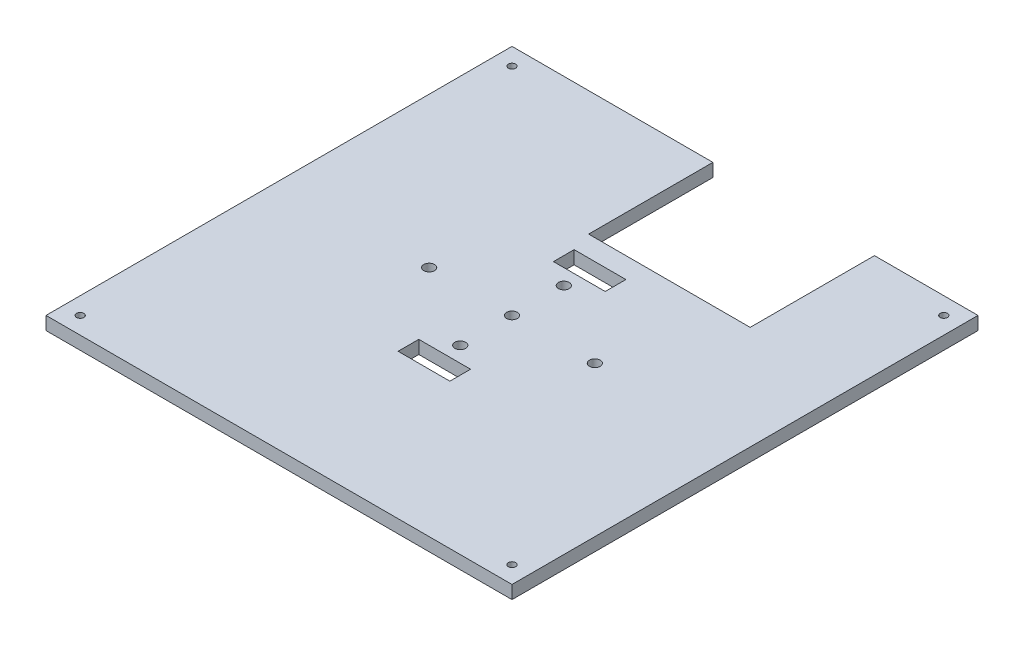
ISO-10303-21;
HEADER;
FILE_DESCRIPTION(('STEP AP214'),'2;1');
FILE_NAME('part.step','',(''),(''),'','','');
FILE_SCHEMA(('AUTOMOTIVE_DESIGN { 1 0 10303 214 1 1 1 1 }'));
ENDSEC;
DATA;
#1=APPLICATION_CONTEXT('core data for automotive mechanical design processes');
#2=APPLICATION_PROTOCOL_DEFINITION('international standard','automotive_design',2000,#1);
#3=PRODUCT_CONTEXT('',#1,'mechanical');
#4=PRODUCT('Part','Part','',(#3));
#5=PRODUCT_RELATED_PRODUCT_CATEGORY('part','',(#4));
#6=PRODUCT_DEFINITION_FORMATION('','',#4);
#7=PRODUCT_DEFINITION_CONTEXT('part definition',#1,'design');
#8=PRODUCT_DEFINITION('design','',#6,#7);
#9=PRODUCT_DEFINITION_SHAPE('','',#8);
#10=(LENGTH_UNIT() NAMED_UNIT(*) SI_UNIT(.MILLI.,.METRE.));
#11=(NAMED_UNIT(*) PLANE_ANGLE_UNIT() SI_UNIT($,.RADIAN.));
#12=(NAMED_UNIT(*) SI_UNIT($,.STERADIAN.) SOLID_ANGLE_UNIT());
#13=UNCERTAINTY_MEASURE_WITH_UNIT(LENGTH_MEASURE(1.E-05),#10,'distance_accuracy_value','');
#14=(GEOMETRIC_REPRESENTATION_CONTEXT(3) GLOBAL_UNCERTAINTY_ASSIGNED_CONTEXT((#13)) GLOBAL_UNIT_ASSIGNED_CONTEXT((#10,
#11,#12)) REPRESENTATION_CONTEXT('',''));
#15=CARTESIAN_POINT('',(0.,0.,0.));
#16=DIRECTION('',(0.,0.,1.));
#17=DIRECTION('',(1.,0.,0.));
#18=AXIS2_PLACEMENT_3D('',#15,#16,#17);
#19=CARTESIAN_POINT('',(0.,6.35,-225.));
#20=DIRECTION('',(0.,0.,1.));
#21=DIRECTION('',(1.,0.,0.));
#22=AXIS2_PLACEMENT_3D('',#19,#20,#21);
#23=PLANE('',#22);
#24=DIRECTION('',(-1.,0.,0.));
#25=VECTOR('',#24,1.);
#26=CARTESIAN_POINT('',(0.,6.35,-225.));
#27=LINE('',#26,#25);
#28=CARTESIAN_POINT('',(97.,6.35,-225.));
#29=VERTEX_POINT('',#28);
#30=CARTESIAN_POINT('',(0.,6.35,-225.));
#31=VERTEX_POINT('',#30);
#32=EDGE_CURVE('E167',#29,#31,#27,.T.);
#33=ORIENTED_EDGE('',*,*,#32,.F.);
#34=DIRECTION('',(0.,1.,0.));
#35=VECTOR('',#34,1.);
#36=CARTESIAN_POINT('',(97.,-98.4073168011403,-225.));
#37=LINE('',#36,#35);
#38=CARTESIAN_POINT('',(97.,0.,-225.));
#39=VERTEX_POINT('',#38);
#40=EDGE_CURVE('E155',#39,#29,#37,.T.);
#41=ORIENTED_EDGE('',*,*,#40,.F.);
#42=DIRECTION('',(-1.,0.,0.));
#43=VECTOR('',#42,1.);
#44=CARTESIAN_POINT('',(0.,0.,-225.));
#45=LINE('',#44,#43);
#46=CARTESIAN_POINT('',(0.,0.,-225.));
#47=VERTEX_POINT('',#46);
#48=EDGE_CURVE('E165',#39,#47,#45,.T.);
#49=ORIENTED_EDGE('',*,*,#48,.T.);
#50=DIRECTION('',(0.,-1.,0.));
#51=VECTOR('',#50,1.);
#52=CARTESIAN_POINT('',(0.,6.35,-225.));
#53=LINE('',#52,#51);
#54=EDGE_CURVE('E184',#31,#47,#53,.T.);
#55=ORIENTED_EDGE('',*,*,#54,.F.);
#56=EDGE_LOOP('',(#33,#41,#49,#55));
#57=FACE_BOUND('',#56,.T.);
#58=ADVANCED_FACE('F36',(#57),#23,.F.);
#59=CARTESIAN_POINT('',(0.,6.35,0.));
#60=DIRECTION('',(1.,0.,0.));
#61=DIRECTION('',(0.,0.,-1.));
#62=AXIS2_PLACEMENT_3D('',#59,#60,#61);
#63=PLANE('',#62);
#64=DIRECTION('',(0.,0.,1.));
#65=VECTOR('',#64,1.);
#66=CARTESIAN_POINT('',(0.,0.,0.));
#67=LINE('',#66,#65);
#68=CARTESIAN_POINT('',(0.,0.,0.));
#69=VERTEX_POINT('',#68);
#70=EDGE_CURVE('E174',#47,#69,#67,.T.);
#71=ORIENTED_EDGE('',*,*,#70,.T.);
#72=DIRECTION('',(0.,-1.,0.));
#73=VECTOR('',#72,1.);
#74=CARTESIAN_POINT('',(0.,6.35,0.));
#75=LINE('',#74,#73);
#76=CARTESIAN_POINT('',(0.,6.35,0.));
#77=VERTEX_POINT('',#76);
#78=EDGE_CURVE('E11',#77,#69,#75,.T.);
#79=ORIENTED_EDGE('',*,*,#78,.F.);
#80=DIRECTION('',(0.,0.,1.));
#81=VECTOR('',#80,1.);
#82=CARTESIAN_POINT('',(0.,6.35,0.));
#83=LINE('',#82,#81);
#84=EDGE_CURVE('E179',#31,#77,#83,.T.);
#85=ORIENTED_EDGE('',*,*,#84,.F.);
#86=ORIENTED_EDGE('',*,*,#54,.T.);
#87=EDGE_LOOP('',(#71,#79,#85,#86));
#88=FACE_BOUND('',#87,.T.);
#89=ADVANCED_FACE('F38',(#88),#63,.F.);
#90=CARTESIAN_POINT('',(0.,6.35,0.));
#91=DIRECTION('',(0.,0.,-1.));
#92=DIRECTION('',(-1.,0.,0.));
#93=AXIS2_PLACEMENT_3D('',#90,#91,#92);
#94=PLANE('',#93);
#95=DIRECTION('',(1.,0.,0.));
#96=VECTOR('',#95,1.);
#97=CARTESIAN_POINT('',(0.,0.,0.));
#98=LINE('',#97,#96);
#99=CARTESIAN_POINT('',(225.,0.,0.));
#100=VERTEX_POINT('',#99);
#101=EDGE_CURVE('E180',#69,#100,#98,.T.);
#102=ORIENTED_EDGE('',*,*,#101,.T.);
#103=DIRECTION('',(0.,-1.,0.));
#104=VECTOR('',#103,1.);
#105=CARTESIAN_POINT('',(225.,6.35,0.));
#106=LINE('',#105,#104);
#107=CARTESIAN_POINT('',(225.,6.35,0.));
#108=VERTEX_POINT('',#107);
#109=EDGE_CURVE('E44',#108,#100,#106,.T.);
#110=ORIENTED_EDGE('',*,*,#109,.F.);
#111=DIRECTION('',(1.,0.,0.));
#112=VECTOR('',#111,1.);
#113=CARTESIAN_POINT('',(0.,6.35,0.));
#114=LINE('',#113,#112);
#115=EDGE_CURVE('E216',#77,#108,#114,.T.);
#116=ORIENTED_EDGE('',*,*,#115,.F.);
#117=ORIENTED_EDGE('',*,*,#78,.T.);
#118=EDGE_LOOP('',(#102,#110,#116,#117));
#119=FACE_BOUND('',#118,.T.);
#120=ADVANCED_FACE('F214',(#119),#94,.F.);
#121=CARTESIAN_POINT('',(225.,6.35,0.));
#122=DIRECTION('',(-1.,0.,0.));
#123=DIRECTION('',(0.,0.,1.));
#124=AXIS2_PLACEMENT_3D('',#121,#122,#123);
#125=PLANE('',#124);
#126=DIRECTION('',(0.,0.,-1.));
#127=VECTOR('',#126,1.);
#128=CARTESIAN_POINT('',(225.,0.,0.));
#129=LINE('',#128,#127);
#130=CARTESIAN_POINT('',(225.,0.,-225.));
#131=VERTEX_POINT('',#130);
#132=EDGE_CURVE('E176',#100,#131,#129,.T.);
#133=ORIENTED_EDGE('',*,*,#132,.T.);
#134=DIRECTION('',(0.,-1.,0.));
#135=VECTOR('',#134,1.);
#136=CARTESIAN_POINT('',(225.,6.35,-225.));
#137=LINE('',#136,#135);
#138=CARTESIAN_POINT('',(225.,6.35,-225.));
#139=VERTEX_POINT('',#138);
#140=EDGE_CURVE('E186',#139,#131,#137,.T.);
#141=ORIENTED_EDGE('',*,*,#140,.F.);
#142=DIRECTION('',(0.,0.,-1.));
#143=VECTOR('',#142,1.);
#144=CARTESIAN_POINT('',(225.,6.35,0.));
#145=LINE('',#144,#143);
#146=EDGE_CURVE('E196',#108,#139,#145,.T.);
#147=ORIENTED_EDGE('',*,*,#146,.F.);
#148=ORIENTED_EDGE('',*,*,#109,.T.);
#149=EDGE_LOOP('',(#133,#141,#147,#148));
#150=FACE_BOUND('',#149,.T.);
#151=ADVANCED_FACE('F194',(#150),#125,.F.);
#152=CARTESIAN_POINT('',(175.,0.,-225.));
#153=VERTEX_POINT('',#152);
#154=EDGE_CURVE('E175',#131,#153,#45,.T.);
#155=ORIENTED_EDGE('',*,*,#154,.T.);
#156=DIRECTION('',(0.,1.,0.));
#157=VECTOR('',#156,1.);
#158=CARTESIAN_POINT('',(175.,-98.4073168011403,-225.));
#159=LINE('',#158,#157);
#160=CARTESIAN_POINT('',(175.,6.35,-225.));
#161=VERTEX_POINT('',#160);
#162=EDGE_CURVE('E205',#153,#161,#159,.T.);
#163=ORIENTED_EDGE('',*,*,#162,.T.);
#164=EDGE_CURVE('E187',#139,#161,#27,.T.);
#165=ORIENTED_EDGE('',*,*,#164,.F.);
#166=ORIENTED_EDGE('',*,*,#140,.T.);
#167=EDGE_LOOP('',(#155,#163,#165,#166));
#168=FACE_BOUND('',#167,.T.);
#169=ADVANCED_FACE('F203',(#168),#23,.F.);
#170=CARTESIAN_POINT('',(0.,6.35,0.));
#171=DIRECTION('',(0.,-1.,0.));
#172=DIRECTION('',(0.,0.,-1.));
#173=AXIS2_PLACEMENT_3D('',#170,#171,#172);
#174=PLANE('',#173);
#175=CARTESIAN_POINT('',(112.5,6.35,-137.5));
#176=DIRECTION('',(0.,1.,0.));
#177=DIRECTION('',(0.,0.,1.));
#178=AXIS2_PLACEMENT_3D('',#175,#176,#177);
#179=CIRCLE('',#178,2.6);
#180=CARTESIAN_POINT('',(112.5,6.35,-134.9));
#181=VERTEX_POINT('',#180);
#182=EDGE_CURVE('E268',#181,#181,#179,.T.);
#183=ORIENTED_EDGE('',*,*,#182,.F.);
#184=EDGE_LOOP('',(#183));
#185=FACE_BOUND('',#184,.T.);
#186=CARTESIAN_POINT('',(112.5,6.35,-87.5));
#187=DIRECTION('',(0.,1.,0.));
#188=DIRECTION('',(0.,0.,1.));
#189=AXIS2_PLACEMENT_3D('',#186,#187,#188);
#190=CIRCLE('',#189,2.6);
#191=CARTESIAN_POINT('',(112.5,6.35,-84.9));
#192=VERTEX_POINT('',#191);
#193=EDGE_CURVE('E267',#192,#192,#190,.T.);
#194=ORIENTED_EDGE('',*,*,#193,.F.);
#195=EDGE_LOOP('',(#194));
#196=FACE_BOUND('',#195,.T.);
#197=CARTESIAN_POINT('',(72.5,6.35,-112.5));
#198=DIRECTION('',(0.,1.,0.));
#199=DIRECTION('',(0.,0.,1.));
#200=AXIS2_PLACEMENT_3D('',#197,#198,#199);
#201=CIRCLE('',#200,2.6);
#202=CARTESIAN_POINT('',(72.5,6.35,-109.9));
#203=VERTEX_POINT('',#202);
#204=EDGE_CURVE('E256',#203,#203,#201,.T.);
#205=ORIENTED_EDGE('',*,*,#204,.F.);
#206=EDGE_LOOP('',(#205));
#207=FACE_BOUND('',#206,.T.);
#208=CARTESIAN_POINT('',(112.5,6.35,-112.5));
#209=DIRECTION('',(0.,1.,0.));
#210=DIRECTION('',(0.,0.,1.));
#211=AXIS2_PLACEMENT_3D('',#208,#209,#210);
#212=CIRCLE('',#211,2.6);
#213=CARTESIAN_POINT('',(112.5,6.35,-109.9));
#214=VERTEX_POINT('',#213);
#215=EDGE_CURVE('E255',#214,#214,#212,.T.);
#216=ORIENTED_EDGE('',*,*,#215,.F.);
#217=EDGE_LOOP('',(#216));
#218=FACE_BOUND('',#217,.T.);
#219=DIRECTION('',(0.,0.,1.));
#220=VECTOR('',#219,1.);
#221=CARTESIAN_POINT('',(100.,6.35,-145.));
#222=LINE('',#221,#220);
#223=CARTESIAN_POINT('',(100.,6.35,-155.));
#224=VERTEX_POINT('',#223);
#225=CARTESIAN_POINT('',(100.,6.35,-145.));
#226=VERTEX_POINT('',#225);
#227=EDGE_CURVE('E332',#224,#226,#222,.T.);
#228=ORIENTED_EDGE('',*,*,#227,.F.);
#229=DIRECTION('',(-1.,0.,0.));
#230=VECTOR('',#229,1.);
#231=CARTESIAN_POINT('',(125.,6.35,-155.));
#232=LINE('',#231,#230);
#233=CARTESIAN_POINT('',(125.,6.35,-155.));
#234=VERTEX_POINT('',#233);
#235=EDGE_CURVE('E329',#234,#224,#232,.T.);
#236=ORIENTED_EDGE('',*,*,#235,.F.);
#237=DIRECTION('',(0.,0.,-1.));
#238=VECTOR('',#237,1.);
#239=CARTESIAN_POINT('',(125.,6.35,-145.));
#240=LINE('',#239,#238);
#241=CARTESIAN_POINT('',(125.,6.35,-145.));
#242=VERTEX_POINT('',#241);
#243=EDGE_CURVE('E277',#242,#234,#240,.T.);
#244=ORIENTED_EDGE('',*,*,#243,.F.);
#245=DIRECTION('',(1.,0.,0.));
#246=VECTOR('',#245,1.);
#247=CARTESIAN_POINT('',(125.,6.35,-145.));
#248=LINE('',#247,#246);
#249=EDGE_CURVE('E51',#226,#242,#248,.T.);
#250=ORIENTED_EDGE('',*,*,#249,.F.);
#251=EDGE_LOOP('',(#228,#236,#244,#250));
#252=FACE_BOUND('',#251,.T.);
#253=DIRECTION('',(0.,0.,1.));
#254=VECTOR('',#253,1.);
#255=CARTESIAN_POINT('',(100.,6.35,-80.));
#256=LINE('',#255,#254);
#257=CARTESIAN_POINT('',(100.,6.35,-80.));
#258=VERTEX_POINT('',#257);
#259=CARTESIAN_POINT('',(100.,6.35,-70.));
#260=VERTEX_POINT('',#259);
#261=EDGE_CURVE('E302',#258,#260,#256,.T.);
#262=ORIENTED_EDGE('',*,*,#261,.F.);
#263=DIRECTION('',(-1.,0.,0.));
#264=VECTOR('',#263,1.);
#265=CARTESIAN_POINT('',(125.,6.35,-80.));
#266=LINE('',#265,#264);
#267=CARTESIAN_POINT('',(125.,6.35,-80.));
#268=VERTEX_POINT('',#267);
#269=EDGE_CURVE('E299',#268,#258,#266,.T.);
#270=ORIENTED_EDGE('',*,*,#269,.F.);
#271=DIRECTION('',(0.,0.,-1.));
#272=VECTOR('',#271,1.);
#273=CARTESIAN_POINT('',(125.,6.35,-80.));
#274=LINE('',#273,#272);
#275=CARTESIAN_POINT('',(125.,6.35,-70.));
#276=VERTEX_POINT('',#275);
#277=EDGE_CURVE('E296',#276,#268,#274,.T.);
#278=ORIENTED_EDGE('',*,*,#277,.F.);
#279=DIRECTION('',(1.,0.,0.));
#280=VECTOR('',#279,1.);
#281=CARTESIAN_POINT('',(125.,6.35,-70.));
#282=LINE('',#281,#280);
#283=EDGE_CURVE('E59',#260,#276,#282,.T.);
#284=ORIENTED_EDGE('',*,*,#283,.F.);
#285=EDGE_LOOP('',(#262,#270,#278,#284));
#286=FACE_BOUND('',#285,.T.);
#287=CARTESIAN_POINT('',(152.5,6.35,-112.5));
#288=DIRECTION('',(0.,1.,0.));
#289=DIRECTION('',(0.,0.,1.));
#290=AXIS2_PLACEMENT_3D('',#287,#288,#289);
#291=CIRCLE('',#290,2.59999999999999);
#292=CARTESIAN_POINT('',(152.5,6.35,-109.9));
#293=VERTEX_POINT('',#292);
#294=EDGE_CURVE('E248',#293,#293,#291,.T.);
#295=ORIENTED_EDGE('',*,*,#294,.F.);
#296=EDGE_LOOP('',(#295));
#297=FACE_BOUND('',#296,.T.);
#298=CARTESIAN_POINT('',(8.25999999999999,6.35,-216.74));
#299=DIRECTION('',(0.,1.,0.));
#300=DIRECTION('',(0.,0.,-1.));
#301=AXIS2_PLACEMENT_3D('',#298,#299,#300);
#302=CIRCLE('',#301,1.75000000000001);
#303=CARTESIAN_POINT('',(8.25999999999999,6.35,-218.49));
#304=VERTEX_POINT('',#303);
#305=EDGE_CURVE('E235',#304,#304,#302,.T.);
#306=ORIENTED_EDGE('',*,*,#305,.F.);
#307=EDGE_LOOP('',(#306));
#308=FACE_BOUND('',#307,.T.);
#309=CARTESIAN_POINT('',(216.74,6.35,-8.26000000000002));
#310=DIRECTION('',(0.,1.,0.));
#311=DIRECTION('',(0.,0.,-1.));
#312=AXIS2_PLACEMENT_3D('',#309,#310,#311);
#313=CIRCLE('',#312,1.75000000000001);
#314=CARTESIAN_POINT('',(216.74,6.35,-10.01));
#315=VERTEX_POINT('',#314);
#316=EDGE_CURVE('E228',#315,#315,#313,.T.);
#317=ORIENTED_EDGE('',*,*,#316,.F.);
#318=EDGE_LOOP('',(#317));
#319=FACE_BOUND('',#318,.T.);
#320=CARTESIAN_POINT('',(8.26000000000002,6.35,-8.25999999999996));
#321=DIRECTION('',(0.,1.,0.));
#322=DIRECTION('',(0.,0.,1.));
#323=AXIS2_PLACEMENT_3D('',#320,#321,#322);
#324=CIRCLE('',#323,1.75000000000001);
#325=CARTESIAN_POINT('',(8.26000000000002,6.35,-6.50999999999995));
#326=VERTEX_POINT('',#325);
#327=EDGE_CURVE('E240',#326,#326,#324,.T.);
#328=ORIENTED_EDGE('',*,*,#327,.F.);
#329=EDGE_LOOP('',(#328));
#330=FACE_BOUND('',#329,.T.);
#331=CARTESIAN_POINT('',(216.74,6.35,-216.74));
#332=DIRECTION('',(0.,1.,0.));
#333=DIRECTION('',(0.,0.,1.));
#334=AXIS2_PLACEMENT_3D('',#331,#332,#333);
#335=CIRCLE('',#334,1.75000000000001);
#336=CARTESIAN_POINT('',(216.74,6.35,-214.99));
#337=VERTEX_POINT('',#336);
#338=EDGE_CURVE('E222',#337,#337,#335,.T.);
#339=ORIENTED_EDGE('',*,*,#338,.F.);
#340=EDGE_LOOP('',(#339));
#341=FACE_BOUND('',#340,.T.);
#342=DIRECTION('',(1.,0.,0.));
#343=VECTOR('',#342,1.);
#344=CARTESIAN_POINT('',(175.,6.35,-165.));
#345=LINE('',#344,#343);
#346=CARTESIAN_POINT('',(97.,6.35,-165.));
#347=VERTEX_POINT('',#346);
#348=CARTESIAN_POINT('',(175.,6.35,-165.));
#349=VERTEX_POINT('',#348);
#350=EDGE_CURVE('E168',#347,#349,#345,.T.);
#351=ORIENTED_EDGE('',*,*,#350,.F.);
#352=DIRECTION('',(0.,0.,1.));
#353=VECTOR('',#352,1.);
#354=CARTESIAN_POINT('',(97.,6.35,-225.));
#355=LINE('',#354,#353);
#356=EDGE_CURVE('E344',#29,#347,#355,.T.);
#357=ORIENTED_EDGE('',*,*,#356,.F.);
#358=ORIENTED_EDGE('',*,*,#32,.T.);
#359=ORIENTED_EDGE('',*,*,#84,.T.);
#360=ORIENTED_EDGE('',*,*,#115,.T.);
#361=ORIENTED_EDGE('',*,*,#146,.T.);
#362=ORIENTED_EDGE('',*,*,#164,.T.);
#363=DIRECTION('',(0.,0.,-1.));
#364=VECTOR('',#363,1.);
#365=CARTESIAN_POINT('',(175.,6.35,-225.));
#366=LINE('',#365,#364);
#367=EDGE_CURVE('E308',#349,#161,#366,.T.);
#368=ORIENTED_EDGE('',*,*,#367,.F.);
#369=EDGE_LOOP('',(#351,#357,#358,#359,#360,#361,#362,#368));
#370=FACE_BOUND('',#369,.T.);
#371=ADVANCED_FACE('F351',(#185,#196,#207,#218,#252,#286,#297,#308,#319,#330,#341,#370),#174,.F.);
#372=CARTESIAN_POINT('',(0.,0.,0.));
#373=DIRECTION('',(0.,-1.,0.));
#374=DIRECTION('',(0.,0.,-1.));
#375=AXIS2_PLACEMENT_3D('',#372,#373,#374);
#376=PLANE('',#375);
#377=CARTESIAN_POINT('',(112.5,0.,-137.5));
#378=DIRECTION('',(0.,-1.,0.));
#379=DIRECTION('',(0.,0.,-1.));
#380=AXIS2_PLACEMENT_3D('',#377,#378,#379);
#381=CIRCLE('',#380,2.6);
#382=CARTESIAN_POINT('',(112.5,0.,-140.1));
#383=VERTEX_POINT('',#382);
#384=EDGE_CURVE('E264',#383,#383,#381,.F.);
#385=ORIENTED_EDGE('',*,*,#384,.T.);
#386=EDGE_LOOP('',(#385));
#387=FACE_BOUND('',#386,.T.);
#388=CARTESIAN_POINT('',(112.5,0.,-87.5));
#389=DIRECTION('',(0.,-1.,0.));
#390=DIRECTION('',(0.,0.,-1.));
#391=AXIS2_PLACEMENT_3D('',#388,#389,#390);
#392=CIRCLE('',#391,2.6);
#393=CARTESIAN_POINT('',(112.5,0.,-90.1));
#394=VERTEX_POINT('',#393);
#395=EDGE_CURVE('E259',#394,#394,#392,.F.);
#396=ORIENTED_EDGE('',*,*,#395,.T.);
#397=EDGE_LOOP('',(#396));
#398=FACE_BOUND('',#397,.T.);
#399=CARTESIAN_POINT('',(72.5,0.,-112.5));
#400=DIRECTION('',(0.,-1.,0.));
#401=DIRECTION('',(0.,0.,-1.));
#402=AXIS2_PLACEMENT_3D('',#399,#400,#401);
#403=CIRCLE('',#402,2.6);
#404=CARTESIAN_POINT('',(72.5,0.,-115.1));
#405=VERTEX_POINT('',#404);
#406=EDGE_CURVE('E252',#405,#405,#403,.F.);
#407=ORIENTED_EDGE('',*,*,#406,.T.);
#408=EDGE_LOOP('',(#407));
#409=FACE_BOUND('',#408,.T.);
#410=CARTESIAN_POINT('',(112.5,0.,-112.5));
#411=DIRECTION('',(0.,-1.,0.));
#412=DIRECTION('',(0.,0.,-1.));
#413=AXIS2_PLACEMENT_3D('',#410,#411,#412);
#414=CIRCLE('',#413,2.6);
#415=CARTESIAN_POINT('',(112.5,0.,-115.1));
#416=VERTEX_POINT('',#415);
#417=EDGE_CURVE('E251',#416,#416,#414,.F.);
#418=ORIENTED_EDGE('',*,*,#417,.T.);
#419=EDGE_LOOP('',(#418));
#420=FACE_BOUND('',#419,.T.);
#421=DIRECTION('',(0.,0.,1.));
#422=VECTOR('',#421,1.);
#423=CARTESIAN_POINT('',(97.,0.,-225.));
#424=LINE('',#423,#422);
#425=CARTESIAN_POINT('',(97.,0.,-165.));
#426=VERTEX_POINT('',#425);
#427=EDGE_CURVE('E151',#39,#426,#424,.T.);
#428=ORIENTED_EDGE('',*,*,#427,.T.);
#429=DIRECTION('',(1.,0.,0.));
#430=VECTOR('',#429,1.);
#431=CARTESIAN_POINT('',(175.,0.,-165.));
#432=LINE('',#431,#430);
#433=CARTESIAN_POINT('',(175.,0.,-165.));
#434=VERTEX_POINT('',#433);
#435=EDGE_CURVE('E338',#426,#434,#432,.T.);
#436=ORIENTED_EDGE('',*,*,#435,.T.);
#437=DIRECTION('',(0.,0.,-1.));
#438=VECTOR('',#437,1.);
#439=CARTESIAN_POINT('',(175.,0.,-225.));
#440=LINE('',#439,#438);
#441=EDGE_CURVE('E200',#434,#153,#440,.T.);
#442=ORIENTED_EDGE('',*,*,#441,.T.);
#443=ORIENTED_EDGE('',*,*,#154,.F.);
#444=ORIENTED_EDGE('',*,*,#132,.F.);
#445=ORIENTED_EDGE('',*,*,#101,.F.);
#446=ORIENTED_EDGE('',*,*,#70,.F.);
#447=ORIENTED_EDGE('',*,*,#48,.F.);
#448=EDGE_LOOP('',(#428,#436,#442,#443,#444,#445,#446,#447));
#449=FACE_BOUND('',#448,.T.);
#450=DIRECTION('',(-1.,0.,0.));
#451=VECTOR('',#450,1.);
#452=CARTESIAN_POINT('',(125.,0.,-155.));
#453=LINE('',#452,#451);
#454=CARTESIAN_POINT('',(125.,0.,-155.));
#455=VERTEX_POINT('',#454);
#456=CARTESIAN_POINT('',(100.,0.,-155.));
#457=VERTEX_POINT('',#456);
#458=EDGE_CURVE('E313',#455,#457,#453,.T.);
#459=ORIENTED_EDGE('',*,*,#458,.T.);
#460=DIRECTION('',(0.,0.,1.));
#461=VECTOR('',#460,1.);
#462=CARTESIAN_POINT('',(100.,0.,-145.));
#463=LINE('',#462,#461);
#464=CARTESIAN_POINT('',(100.,0.,-145.));
#465=VERTEX_POINT('',#464);
#466=EDGE_CURVE('E312',#457,#465,#463,.T.);
#467=ORIENTED_EDGE('',*,*,#466,.T.);
#468=DIRECTION('',(1.,0.,0.));
#469=VECTOR('',#468,1.);
#470=CARTESIAN_POINT('',(125.,0.,-145.));
#471=LINE('',#470,#469);
#472=CARTESIAN_POINT('',(125.,0.,-145.));
#473=VERTEX_POINT('',#472);
#474=EDGE_CURVE('E316',#465,#473,#471,.T.);
#475=ORIENTED_EDGE('',*,*,#474,.T.);
#476=DIRECTION('',(0.,0.,-1.));
#477=VECTOR('',#476,1.);
#478=CARTESIAN_POINT('',(125.,0.,-145.));
#479=LINE('',#478,#477);
#480=EDGE_CURVE('E309',#473,#455,#479,.T.);
#481=ORIENTED_EDGE('',*,*,#480,.T.);
#482=EDGE_LOOP('',(#459,#467,#475,#481));
#483=FACE_BOUND('',#482,.T.);
#484=DIRECTION('',(-1.,0.,0.));
#485=VECTOR('',#484,1.);
#486=CARTESIAN_POINT('',(125.,0.,-80.));
#487=LINE('',#486,#485);
#488=CARTESIAN_POINT('',(125.,0.,-80.));
#489=VERTEX_POINT('',#488);
#490=CARTESIAN_POINT('',(100.,0.,-80.));
#491=VERTEX_POINT('',#490);
#492=EDGE_CURVE('E282',#489,#491,#487,.T.);
#493=ORIENTED_EDGE('',*,*,#492,.T.);
#494=DIRECTION('',(0.,0.,1.));
#495=VECTOR('',#494,1.);
#496=CARTESIAN_POINT('',(100.,0.,-80.));
#497=LINE('',#496,#495);
#498=CARTESIAN_POINT('',(100.,0.,-70.));
#499=VERTEX_POINT('',#498);
#500=EDGE_CURVE('E281',#491,#499,#497,.T.);
#501=ORIENTED_EDGE('',*,*,#500,.T.);
#502=DIRECTION('',(1.,0.,0.));
#503=VECTOR('',#502,1.);
#504=CARTESIAN_POINT('',(125.,0.,-70.));
#505=LINE('',#504,#503);
#506=CARTESIAN_POINT('',(125.,0.,-70.));
#507=VERTEX_POINT('',#506);
#508=EDGE_CURVE('E285',#499,#507,#505,.T.);
#509=ORIENTED_EDGE('',*,*,#508,.T.);
#510=DIRECTION('',(0.,0.,-1.));
#511=VECTOR('',#510,1.);
#512=CARTESIAN_POINT('',(125.,0.,-80.));
#513=LINE('',#512,#511);
#514=EDGE_CURVE('E278',#507,#489,#513,.T.);
#515=ORIENTED_EDGE('',*,*,#514,.T.);
#516=EDGE_LOOP('',(#493,#501,#509,#515));
#517=FACE_BOUND('',#516,.T.);
#518=CARTESIAN_POINT('',(152.5,0.,-112.5));
#519=DIRECTION('',(0.,-1.,0.));
#520=DIRECTION('',(0.,0.,-1.));
#521=AXIS2_PLACEMENT_3D('',#518,#519,#520);
#522=CIRCLE('',#521,2.59999999999999);
#523=CARTESIAN_POINT('',(152.5,0.,-115.1));
#524=VERTEX_POINT('',#523);
#525=EDGE_CURVE('E243',#524,#524,#522,.F.);
#526=ORIENTED_EDGE('',*,*,#525,.T.);
#527=EDGE_LOOP('',(#526));
#528=FACE_BOUND('',#527,.T.);
#529=CARTESIAN_POINT('',(8.25999999999999,0.,-216.74));
#530=DIRECTION('',(0.,1.,0.));
#531=DIRECTION('',(0.,0.,-1.));
#532=AXIS2_PLACEMENT_3D('',#529,#530,#531);
#533=CIRCLE('',#532,1.75000000000001);
#534=CARTESIAN_POINT('',(8.25999999999999,0.,-218.49));
#535=VERTEX_POINT('',#534);
#536=EDGE_CURVE('E225',#535,#535,#533,.T.);
#537=ORIENTED_EDGE('',*,*,#536,.T.);
#538=EDGE_LOOP('',(#537));
#539=FACE_BOUND('',#538,.T.);
#540=CARTESIAN_POINT('',(216.74,0.,-8.26000000000002));
#541=DIRECTION('',(0.,1.,0.));
#542=DIRECTION('',(0.,0.,-1.));
#543=AXIS2_PLACEMENT_3D('',#540,#541,#542);
#544=CIRCLE('',#543,1.75000000000001);
#545=CARTESIAN_POINT('',(216.74,0.,-10.01));
#546=VERTEX_POINT('',#545);
#547=EDGE_CURVE('E231',#546,#546,#544,.T.);
#548=ORIENTED_EDGE('',*,*,#547,.T.);
#549=EDGE_LOOP('',(#548));
#550=FACE_BOUND('',#549,.T.);
#551=CARTESIAN_POINT('',(8.26000000000002,0.,-8.25999999999996));
#552=DIRECTION('',(0.,1.,0.));
#553=DIRECTION('',(0.,0.,1.));
#554=AXIS2_PLACEMENT_3D('',#551,#552,#553);
#555=CIRCLE('',#554,1.75000000000001);
#556=CARTESIAN_POINT('',(8.26000000000002,0.,-6.50999999999995));
#557=VERTEX_POINT('',#556);
#558=EDGE_CURVE('E232',#557,#557,#555,.T.);
#559=ORIENTED_EDGE('',*,*,#558,.T.);
#560=EDGE_LOOP('',(#559));
#561=FACE_BOUND('',#560,.T.);
#562=CARTESIAN_POINT('',(216.74,0.,-216.74));
#563=DIRECTION('',(0.,1.,0.));
#564=DIRECTION('',(0.,0.,1.));
#565=AXIS2_PLACEMENT_3D('',#562,#563,#564);
#566=CIRCLE('',#565,1.75000000000001);
#567=CARTESIAN_POINT('',(216.74,0.,-214.99));
#568=VERTEX_POINT('',#567);
#569=EDGE_CURVE('E213',#568,#568,#566,.T.);
#570=ORIENTED_EDGE('',*,*,#569,.T.);
#571=EDGE_LOOP('',(#570));
#572=FACE_BOUND('',#571,.T.);
#573=ADVANCED_FACE('F171',(#387,#398,#409,#420,#449,#483,#517,#528,#539,#550,#561,#572),#376,.T.);
#574=CARTESIAN_POINT('',(216.74,0.,-216.74));
#575=DIRECTION('',(0.,1.,0.));
#576=DIRECTION('',(0.,0.,1.));
#577=AXIS2_PLACEMENT_3D('',#574,#575,#576);
#578=CYLINDRICAL_SURFACE('',#577,1.75000000000001);
#579=ORIENTED_EDGE('',*,*,#569,.F.);
#580=EDGE_LOOP('',(#579));
#581=FACE_BOUND('',#580,.T.);
#582=ORIENTED_EDGE('',*,*,#338,.T.);
#583=EDGE_LOOP('',(#582));
#584=FACE_BOUND('',#583,.T.);
#585=ADVANCED_FACE('F414',(#581,#584),#578,.F.);
#586=CARTESIAN_POINT('',(8.26000000000002,0.,-8.25999999999996));
#587=DIRECTION('',(0.,1.,0.));
#588=DIRECTION('',(0.,0.,1.));
#589=AXIS2_PLACEMENT_3D('',#586,#587,#588);
#590=CYLINDRICAL_SURFACE('',#589,1.75000000000001);
#591=ORIENTED_EDGE('',*,*,#558,.F.);
#592=EDGE_LOOP('',(#591));
#593=FACE_BOUND('',#592,.T.);
#594=ORIENTED_EDGE('',*,*,#327,.T.);
#595=EDGE_LOOP('',(#594));
#596=FACE_BOUND('',#595,.T.);
#597=ADVANCED_FACE('F422',(#593,#596),#590,.F.);
#598=CARTESIAN_POINT('',(216.74,0.,-8.26000000000002));
#599=DIRECTION('',(0.,1.,0.));
#600=DIRECTION('',(0.,0.,1.));
#601=AXIS2_PLACEMENT_3D('',#598,#599,#600);
#602=CYLINDRICAL_SURFACE('',#601,1.75000000000001);
#603=ORIENTED_EDGE('',*,*,#547,.F.);
#604=EDGE_LOOP('',(#603));
#605=FACE_BOUND('',#604,.T.);
#606=ORIENTED_EDGE('',*,*,#316,.T.);
#607=EDGE_LOOP('',(#606));
#608=FACE_BOUND('',#607,.T.);
#609=ADVANCED_FACE('F431',(#605,#608),#602,.F.);
#610=CARTESIAN_POINT('',(8.25999999999999,0.,-216.74));
#611=DIRECTION('',(0.,1.,0.));
#612=DIRECTION('',(0.,0.,1.));
#613=AXIS2_PLACEMENT_3D('',#610,#611,#612);
#614=CYLINDRICAL_SURFACE('',#613,1.75000000000001);
#615=ORIENTED_EDGE('',*,*,#536,.F.);
#616=EDGE_LOOP('',(#615));
#617=FACE_BOUND('',#616,.T.);
#618=ORIENTED_EDGE('',*,*,#305,.T.);
#619=EDGE_LOOP('',(#618));
#620=FACE_BOUND('',#619,.T.);
#621=ADVANCED_FACE('F440',(#617,#620),#614,.F.);
#622=CARTESIAN_POINT('',(152.5,-98.4073168011403,-112.5));
#623=DIRECTION('',(0.,1.,0.));
#624=DIRECTION('',(0.,0.,1.));
#625=AXIS2_PLACEMENT_3D('',#622,#623,#624);
#626=CYLINDRICAL_SURFACE('',#625,2.59999999999999);
#627=ORIENTED_EDGE('',*,*,#294,.T.);
#628=EDGE_LOOP('',(#627));
#629=FACE_BOUND('',#628,.T.);
#630=ORIENTED_EDGE('',*,*,#525,.F.);
#631=EDGE_LOOP('',(#630));
#632=FACE_BOUND('',#631,.T.);
#633=ADVANCED_FACE('F449',(#629,#632),#626,.F.);
#634=CARTESIAN_POINT('',(125.,-98.4073168011403,-80.));
#635=DIRECTION('',(0.,0.,-1.));
#636=DIRECTION('',(-1.,0.,0.));
#637=AXIS2_PLACEMENT_3D('',#634,#635,#636);
#638=PLANE('',#637);
#639=DIRECTION('',(0.,1.,0.));
#640=VECTOR('',#639,1.);
#641=CARTESIAN_POINT('',(125.,-98.4073168011403,-80.));
#642=LINE('',#641,#640);
#643=EDGE_CURVE('E275',#489,#268,#642,.T.);
#644=ORIENTED_EDGE('',*,*,#643,.T.);
#645=ORIENTED_EDGE('',*,*,#269,.T.);
#646=DIRECTION('',(0.,1.,0.));
#647=VECTOR('',#646,1.);
#648=CARTESIAN_POINT('',(100.,-98.4073168011403,-80.));
#649=LINE('',#648,#647);
#650=EDGE_CURVE('E279',#491,#258,#649,.T.);
#651=ORIENTED_EDGE('',*,*,#650,.F.);
#652=ORIENTED_EDGE('',*,*,#492,.F.);
#653=EDGE_LOOP('',(#644,#645,#651,#652));
#654=FACE_BOUND('',#653,.T.);
#655=ADVANCED_FACE('F461',(#654),#638,.F.);
#656=CARTESIAN_POINT('',(100.,-98.4073168011403,-80.));
#657=DIRECTION('',(-1.,0.,0.));
#658=DIRECTION('',(0.,0.,1.));
#659=AXIS2_PLACEMENT_3D('',#656,#657,#658);
#660=PLANE('',#659);
#661=ORIENTED_EDGE('',*,*,#650,.T.);
#662=ORIENTED_EDGE('',*,*,#261,.T.);
#663=DIRECTION('',(0.,1.,0.));
#664=VECTOR('',#663,1.);
#665=CARTESIAN_POINT('',(100.,-98.4073168011403,-70.));
#666=LINE('',#665,#664);
#667=EDGE_CURVE('E283',#499,#260,#666,.T.);
#668=ORIENTED_EDGE('',*,*,#667,.F.);
#669=ORIENTED_EDGE('',*,*,#500,.F.);
#670=EDGE_LOOP('',(#661,#662,#668,#669));
#671=FACE_BOUND('',#670,.T.);
#672=ADVANCED_FACE('F470',(#671),#660,.F.);
#673=CARTESIAN_POINT('',(125.,-98.4073168011403,-70.));
#674=DIRECTION('',(0.,0.,1.));
#675=DIRECTION('',(1.,0.,0.));
#676=AXIS2_PLACEMENT_3D('',#673,#674,#675);
#677=PLANE('',#676);
#678=ORIENTED_EDGE('',*,*,#667,.T.);
#679=ORIENTED_EDGE('',*,*,#283,.T.);
#680=DIRECTION('',(0.,1.,0.));
#681=VECTOR('',#680,1.);
#682=CARTESIAN_POINT('',(125.,-98.4073168011403,-70.));
#683=LINE('',#682,#681);
#684=EDGE_CURVE('E286',#507,#276,#683,.T.);
#685=ORIENTED_EDGE('',*,*,#684,.F.);
#686=ORIENTED_EDGE('',*,*,#508,.F.);
#687=EDGE_LOOP('',(#678,#679,#685,#686));
#688=FACE_BOUND('',#687,.T.);
#689=ADVANCED_FACE('F479',(#688),#677,.F.);
#690=CARTESIAN_POINT('',(125.,-98.4073168011403,-80.));
#691=DIRECTION('',(1.,0.,0.));
#692=DIRECTION('',(0.,0.,-1.));
#693=AXIS2_PLACEMENT_3D('',#690,#691,#692);
#694=PLANE('',#693);
#695=ORIENTED_EDGE('',*,*,#684,.T.);
#696=ORIENTED_EDGE('',*,*,#277,.T.);
#697=ORIENTED_EDGE('',*,*,#643,.F.);
#698=ORIENTED_EDGE('',*,*,#514,.F.);
#699=EDGE_LOOP('',(#695,#696,#697,#698));
#700=FACE_BOUND('',#699,.T.);
#701=ADVANCED_FACE('F488',(#700),#694,.F.);
#702=CARTESIAN_POINT('',(125.,-98.4073168011403,-155.));
#703=DIRECTION('',(0.,0.,-1.));
#704=DIRECTION('',(-1.,0.,0.));
#705=AXIS2_PLACEMENT_3D('',#702,#703,#704);
#706=PLANE('',#705);
#707=DIRECTION('',(0.,1.,0.));
#708=VECTOR('',#707,1.);
#709=CARTESIAN_POINT('',(125.,-98.4073168011403,-155.));
#710=LINE('',#709,#708);
#711=EDGE_CURVE('E306',#455,#234,#710,.T.);
#712=ORIENTED_EDGE('',*,*,#711,.T.);
#713=ORIENTED_EDGE('',*,*,#235,.T.);
#714=DIRECTION('',(0.,1.,0.));
#715=VECTOR('',#714,1.);
#716=CARTESIAN_POINT('',(100.,-98.4073168011403,-155.));
#717=LINE('',#716,#715);
#718=EDGE_CURVE('E310',#457,#224,#717,.T.);
#719=ORIENTED_EDGE('',*,*,#718,.F.);
#720=ORIENTED_EDGE('',*,*,#458,.F.);
#721=EDGE_LOOP('',(#712,#713,#719,#720));
#722=FACE_BOUND('',#721,.T.);
#723=ADVANCED_FACE('F496',(#722),#706,.F.);
#724=CARTESIAN_POINT('',(100.,-98.4073168011403,-145.));
#725=DIRECTION('',(-1.,0.,0.));
#726=DIRECTION('',(0.,0.,1.));
#727=AXIS2_PLACEMENT_3D('',#724,#725,#726);
#728=PLANE('',#727);
#729=ORIENTED_EDGE('',*,*,#718,.T.);
#730=ORIENTED_EDGE('',*,*,#227,.T.);
#731=DIRECTION('',(0.,1.,0.));
#732=VECTOR('',#731,1.);
#733=CARTESIAN_POINT('',(100.,-98.4073168011403,-145.));
#734=LINE('',#733,#732);
#735=EDGE_CURVE('E314',#465,#226,#734,.T.);
#736=ORIENTED_EDGE('',*,*,#735,.F.);
#737=ORIENTED_EDGE('',*,*,#466,.F.);
#738=EDGE_LOOP('',(#729,#730,#736,#737));
#739=FACE_BOUND('',#738,.T.);
#740=ADVANCED_FACE('F505',(#739),#728,.F.);
#741=CARTESIAN_POINT('',(125.,-98.4073168011403,-145.));
#742=DIRECTION('',(0.,0.,1.));
#743=DIRECTION('',(1.,0.,0.));
#744=AXIS2_PLACEMENT_3D('',#741,#742,#743);
#745=PLANE('',#744);
#746=ORIENTED_EDGE('',*,*,#735,.T.);
#747=ORIENTED_EDGE('',*,*,#249,.T.);
#748=DIRECTION('',(0.,1.,0.));
#749=VECTOR('',#748,1.);
#750=CARTESIAN_POINT('',(125.,-98.4073168011403,-145.));
#751=LINE('',#750,#749);
#752=EDGE_CURVE('E317',#473,#242,#751,.T.);
#753=ORIENTED_EDGE('',*,*,#752,.F.);
#754=ORIENTED_EDGE('',*,*,#474,.F.);
#755=EDGE_LOOP('',(#746,#747,#753,#754));
#756=FACE_BOUND('',#755,.T.);
#757=ADVANCED_FACE('F514',(#756),#745,.F.);
#758=CARTESIAN_POINT('',(125.,-98.4073168011403,-145.));
#759=DIRECTION('',(1.,0.,0.));
#760=DIRECTION('',(0.,0.,-1.));
#761=AXIS2_PLACEMENT_3D('',#758,#759,#760);
#762=PLANE('',#761);
#763=ORIENTED_EDGE('',*,*,#752,.T.);
#764=ORIENTED_EDGE('',*,*,#243,.T.);
#765=ORIENTED_EDGE('',*,*,#711,.F.);
#766=ORIENTED_EDGE('',*,*,#480,.F.);
#767=EDGE_LOOP('',(#763,#764,#765,#766));
#768=FACE_BOUND('',#767,.T.);
#769=ADVANCED_FACE('F523',(#768),#762,.F.);
#770=CARTESIAN_POINT('',(97.,-98.4073168011403,-225.));
#771=DIRECTION('',(-1.,0.,0.));
#772=DIRECTION('',(0.,0.,1.));
#773=AXIS2_PLACEMENT_3D('',#770,#771,#772);
#774=PLANE('',#773);
#775=ORIENTED_EDGE('',*,*,#40,.T.);
#776=ORIENTED_EDGE('',*,*,#356,.T.);
#777=DIRECTION('',(0.,1.,0.));
#778=VECTOR('',#777,1.);
#779=CARTESIAN_POINT('',(97.,-98.4073168011403,-165.));
#780=LINE('',#779,#778);
#781=EDGE_CURVE('E157',#426,#347,#780,.T.);
#782=ORIENTED_EDGE('',*,*,#781,.F.);
#783=ORIENTED_EDGE('',*,*,#427,.F.);
#784=EDGE_LOOP('',(#775,#776,#782,#783));
#785=FACE_BOUND('',#784,.T.);
#786=ADVANCED_FACE('F153',(#785),#774,.F.);
#787=CARTESIAN_POINT('',(175.,-98.4073168011403,-165.));
#788=DIRECTION('',(0.,0.,1.));
#789=DIRECTION('',(1.,0.,0.));
#790=AXIS2_PLACEMENT_3D('',#787,#788,#789);
#791=PLANE('',#790);
#792=ORIENTED_EDGE('',*,*,#781,.T.);
#793=ORIENTED_EDGE('',*,*,#350,.T.);
#794=DIRECTION('',(0.,1.,0.));
#795=VECTOR('',#794,1.);
#796=CARTESIAN_POINT('',(175.,-98.4073168011403,-165.));
#797=LINE('',#796,#795);
#798=EDGE_CURVE('E339',#434,#349,#797,.T.);
#799=ORIENTED_EDGE('',*,*,#798,.F.);
#800=ORIENTED_EDGE('',*,*,#435,.F.);
#801=EDGE_LOOP('',(#792,#793,#799,#800));
#802=FACE_BOUND('',#801,.T.);
#803=ADVANCED_FACE('F350',(#802),#791,.F.);
#804=CARTESIAN_POINT('',(175.,-98.4073168011403,-225.));
#805=DIRECTION('',(1.,0.,0.));
#806=DIRECTION('',(0.,0.,-1.));
#807=AXIS2_PLACEMENT_3D('',#804,#805,#806);
#808=PLANE('',#807);
#809=ORIENTED_EDGE('',*,*,#798,.T.);
#810=ORIENTED_EDGE('',*,*,#367,.T.);
#811=ORIENTED_EDGE('',*,*,#162,.F.);
#812=ORIENTED_EDGE('',*,*,#441,.F.);
#813=EDGE_LOOP('',(#809,#810,#811,#812));
#814=FACE_BOUND('',#813,.T.);
#815=ADVANCED_FACE('F353',(#814),#808,.F.);
#816=CARTESIAN_POINT('',(112.5,-98.4073168011403,-112.5));
#817=DIRECTION('',(0.,1.,0.));
#818=DIRECTION('',(0.,0.,1.));
#819=AXIS2_PLACEMENT_3D('',#816,#817,#818);
#820=CYLINDRICAL_SURFACE('',#819,2.6);
#821=ORIENTED_EDGE('',*,*,#215,.T.);
#822=EDGE_LOOP('',(#821));
#823=FACE_BOUND('',#822,.T.);
#824=ORIENTED_EDGE('',*,*,#417,.F.);
#825=EDGE_LOOP('',(#824));
#826=FACE_BOUND('',#825,.T.);
#827=ADVANCED_FACE('F355',(#823,#826),#820,.F.);
#828=CARTESIAN_POINT('',(72.5,-98.4073168011403,-112.5));
#829=DIRECTION('',(0.,1.,0.));
#830=DIRECTION('',(0.,0.,1.));
#831=AXIS2_PLACEMENT_3D('',#828,#829,#830);
#832=CYLINDRICAL_SURFACE('',#831,2.6);
#833=ORIENTED_EDGE('',*,*,#204,.T.);
#834=EDGE_LOOP('',(#833));
#835=FACE_BOUND('',#834,.T.);
#836=ORIENTED_EDGE('',*,*,#406,.F.);
#837=EDGE_LOOP('',(#836));
#838=FACE_BOUND('',#837,.T.);
#839=ADVANCED_FACE('F361',(#835,#838),#832,.F.);
#840=CARTESIAN_POINT('',(112.5,-98.4073168011403,-87.5));
#841=DIRECTION('',(0.,1.,0.));
#842=DIRECTION('',(0.,0.,1.));
#843=AXIS2_PLACEMENT_3D('',#840,#841,#842);
#844=CYLINDRICAL_SURFACE('',#843,2.6);
#845=ORIENTED_EDGE('',*,*,#193,.T.);
#846=EDGE_LOOP('',(#845));
#847=FACE_BOUND('',#846,.T.);
#848=ORIENTED_EDGE('',*,*,#395,.F.);
#849=EDGE_LOOP('',(#848));
#850=FACE_BOUND('',#849,.T.);
#851=ADVANCED_FACE('F560',(#847,#850),#844,.F.);
#852=CARTESIAN_POINT('',(112.5,-98.4073168011403,-137.5));
#853=DIRECTION('',(0.,1.,0.));
#854=DIRECTION('',(0.,0.,1.));
#855=AXIS2_PLACEMENT_3D('',#852,#853,#854);
#856=CYLINDRICAL_SURFACE('',#855,2.6);
#857=ORIENTED_EDGE('',*,*,#182,.T.);
#858=EDGE_LOOP('',(#857));
#859=FACE_BOUND('',#858,.T.);
#860=ORIENTED_EDGE('',*,*,#384,.F.);
#861=EDGE_LOOP('',(#860));
#862=FACE_BOUND('',#861,.T.);
#863=ADVANCED_FACE('F569',(#859,#862),#856,.F.);
#864=CLOSED_SHELL('',(#58,#89,#120,#151,#169,#371,#573,#585,#597,#609,#621,#633,#655,#672,#689,
#701,#723,#740,#757,#769,#786,#803,#815,#827,#839,#851,#863));
#865=MANIFOLD_SOLID_BREP('B2',#864);
#866=ADVANCED_BREP_SHAPE_REPRESENTATION('',(#18,#865),#14);
#867=SHAPE_DEFINITION_REPRESENTATION(#9,#866);
ENDSEC;
END-ISO-10303-21;
